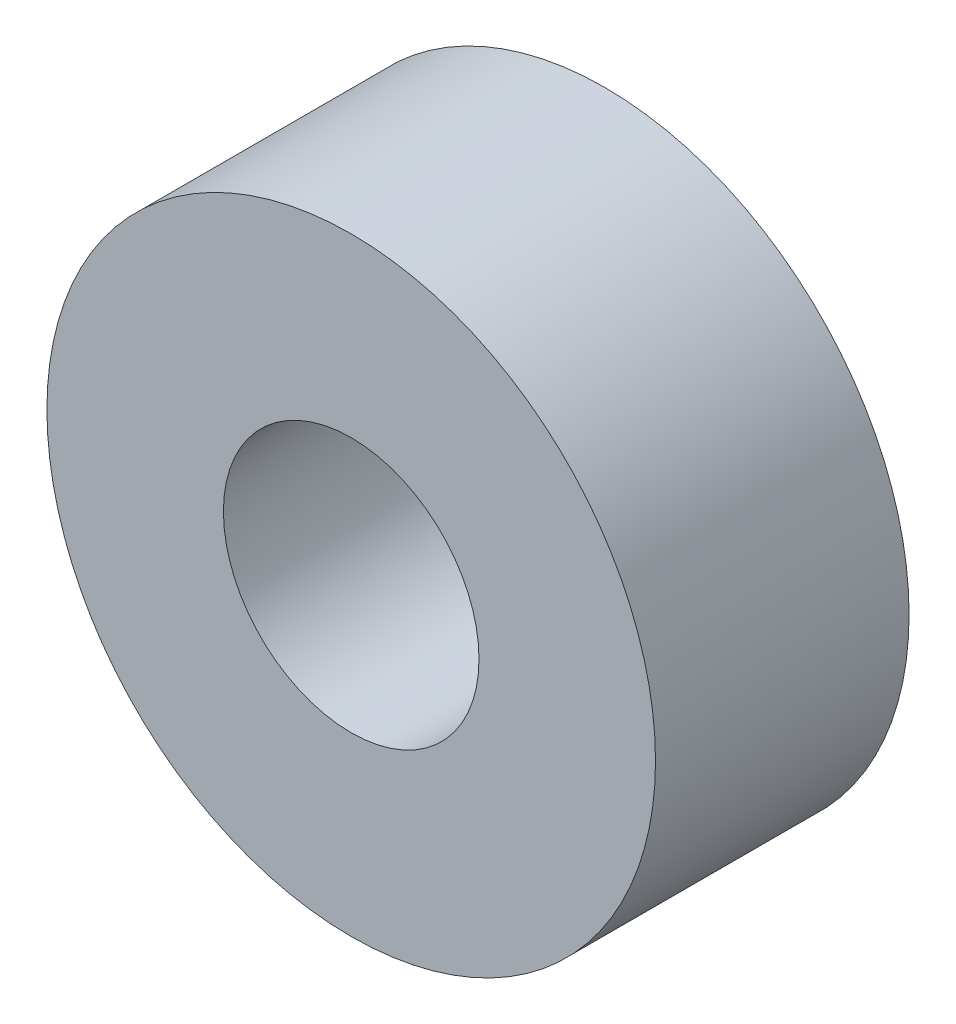
ISO-10303-21;
HEADER;
FILE_DESCRIPTION(('STEP AP214'),'2;1');
FILE_NAME('part.step','',(''),(''),'','','');
FILE_SCHEMA(('AUTOMOTIVE_DESIGN { 1 0 10303 214 1 1 1 1 }'));
ENDSEC;
DATA;
#1=APPLICATION_CONTEXT('core data for automotive mechanical design processes');
#2=APPLICATION_PROTOCOL_DEFINITION('international standard','automotive_design',2000,#1);
#3=PRODUCT_CONTEXT('',#1,'mechanical');
#4=PRODUCT('Part','Part','',(#3));
#5=PRODUCT_RELATED_PRODUCT_CATEGORY('part','',(#4));
#6=PRODUCT_DEFINITION_FORMATION('','',#4);
#7=PRODUCT_DEFINITION_CONTEXT('part definition',#1,'design');
#8=PRODUCT_DEFINITION('design','',#6,#7);
#9=PRODUCT_DEFINITION_SHAPE('','',#8);
#10=(LENGTH_UNIT() NAMED_UNIT(*) SI_UNIT(.MILLI.,.METRE.));
#11=(NAMED_UNIT(*) PLANE_ANGLE_UNIT() SI_UNIT($,.RADIAN.));
#12=(NAMED_UNIT(*) SI_UNIT($,.STERADIAN.) SOLID_ANGLE_UNIT());
#13=UNCERTAINTY_MEASURE_WITH_UNIT(LENGTH_MEASURE(1.E-05),#10,'distance_accuracy_value','');
#14=(GEOMETRIC_REPRESENTATION_CONTEXT(3) GLOBAL_UNCERTAINTY_ASSIGNED_CONTEXT((#13)) GLOBAL_UNIT_ASSIGNED_CONTEXT((#10,
#11,#12)) REPRESENTATION_CONTEXT('',''));
#15=CARTESIAN_POINT('',(0.,0.,0.));
#16=DIRECTION('',(0.,0.,1.));
#17=DIRECTION('',(1.,0.,0.));
#18=AXIS2_PLACEMENT_3D('',#15,#16,#17);
#19=CARTESIAN_POINT('',(0.,0.,3.96875));
#20=DIRECTION('',(0.,0.,1.));
#21=DIRECTION('',(1.,0.,0.));
#22=AXIS2_PLACEMENT_3D('',#19,#20,#21);
#23=PLANE('',#22);
#24=CARTESIAN_POINT('',(0.,0.,3.96875));
#25=DIRECTION('',(0.,0.,1.));
#26=DIRECTION('',(1.,0.,0.));
#27=AXIS2_PLACEMENT_3D('',#24,#25,#26);
#28=CIRCLE('',#27,9.525);
#29=CARTESIAN_POINT('',(9.525,0.,3.96875));
#30=VERTEX_POINT('',#29);
#31=EDGE_CURVE('E10',#30,#30,#28,.T.);
#32=ORIENTED_EDGE('',*,*,#31,.T.);
#33=EDGE_LOOP('',(#32));
#34=FACE_BOUND('',#33,.T.);
#35=CARTESIAN_POINT('',(0.,0.,3.96875));
#36=DIRECTION('',(0.,0.,1.));
#37=DIRECTION('',(1.,0.,0.));
#38=AXIS2_PLACEMENT_3D('',#35,#36,#37);
#39=CIRCLE('',#38,4.0005);
#40=CARTESIAN_POINT('',(4.0005,0.,3.96875));
#41=VERTEX_POINT('',#40);
#42=EDGE_CURVE('E41',#41,#41,#39,.T.);
#43=ORIENTED_EDGE('',*,*,#42,.F.);
#44=EDGE_LOOP('',(#43));
#45=FACE_BOUND('',#44,.T.);
#46=ADVANCED_FACE('F30',(#34,#45),#23,.T.);
#47=CARTESIAN_POINT('',(0.,0.,-3.96875));
#48=DIRECTION('',(0.,0.,1.));
#49=DIRECTION('',(1.,0.,0.));
#50=AXIS2_PLACEMENT_3D('',#47,#48,#49);
#51=PLANE('',#50);
#52=CARTESIAN_POINT('',(0.,0.,-3.96875));
#53=DIRECTION('',(0.,0.,1.));
#54=DIRECTION('',(1.,0.,0.));
#55=AXIS2_PLACEMENT_3D('',#52,#53,#54);
#56=CIRCLE('',#55,9.525);
#57=CARTESIAN_POINT('',(9.525,0.,-3.96875));
#58=VERTEX_POINT('',#57);
#59=EDGE_CURVE('E34',#58,#58,#56,.T.);
#60=ORIENTED_EDGE('',*,*,#59,.F.);
#61=EDGE_LOOP('',(#60));
#62=FACE_BOUND('',#61,.T.);
#63=CARTESIAN_POINT('',(0.,0.,-3.96875));
#64=DIRECTION('',(0.,0.,1.));
#65=DIRECTION('',(1.,0.,0.));
#66=AXIS2_PLACEMENT_3D('',#63,#64,#65);
#67=CIRCLE('',#66,4.0005);
#68=CARTESIAN_POINT('',(4.0005,0.,-3.96875));
#69=VERTEX_POINT('',#68);
#70=EDGE_CURVE('E43',#69,#69,#67,.T.);
#71=ORIENTED_EDGE('',*,*,#70,.T.);
#72=EDGE_LOOP('',(#71));
#73=FACE_BOUND('',#72,.T.);
#74=ADVANCED_FACE('F53',(#62,#73),#51,.F.);
#75=CARTESIAN_POINT('',(0.,0.,3.96875));
#76=DIRECTION('',(0.,0.,-1.));
#77=DIRECTION('',(-1.,0.,0.));
#78=AXIS2_PLACEMENT_3D('',#75,#76,#77);
#79=CYLINDRICAL_SURFACE('',#78,9.525);
#80=ORIENTED_EDGE('',*,*,#31,.F.);
#81=EDGE_LOOP('',(#80));
#82=FACE_BOUND('',#81,.T.);
#83=ORIENTED_EDGE('',*,*,#59,.T.);
#84=EDGE_LOOP('',(#83));
#85=FACE_BOUND('',#84,.T.);
#86=ADVANCED_FACE('F32',(#82,#85),#79,.T.);
#87=CARTESIAN_POINT('',(0.,0.,3.96875));
#88=DIRECTION('',(0.,0.,-1.));
#89=DIRECTION('',(-1.,0.,0.));
#90=AXIS2_PLACEMENT_3D('',#87,#88,#89);
#91=CYLINDRICAL_SURFACE('',#90,4.0005);
#92=ORIENTED_EDGE('',*,*,#42,.T.);
#93=EDGE_LOOP('',(#92));
#94=FACE_BOUND('',#93,.T.);
#95=ORIENTED_EDGE('',*,*,#70,.F.);
#96=EDGE_LOOP('',(#95));
#97=FACE_BOUND('',#96,.T.);
#98=ADVANCED_FACE('F49',(#94,#97),#91,.F.);
#99=CLOSED_SHELL('',(#46,#74,#86,#98));
#100=MANIFOLD_SOLID_BREP('B2',#99);
#101=ADVANCED_BREP_SHAPE_REPRESENTATION('',(#18,#100),#14);
#102=SHAPE_DEFINITION_REPRESENTATION(#9,#101);
ENDSEC;
END-ISO-10303-21;
